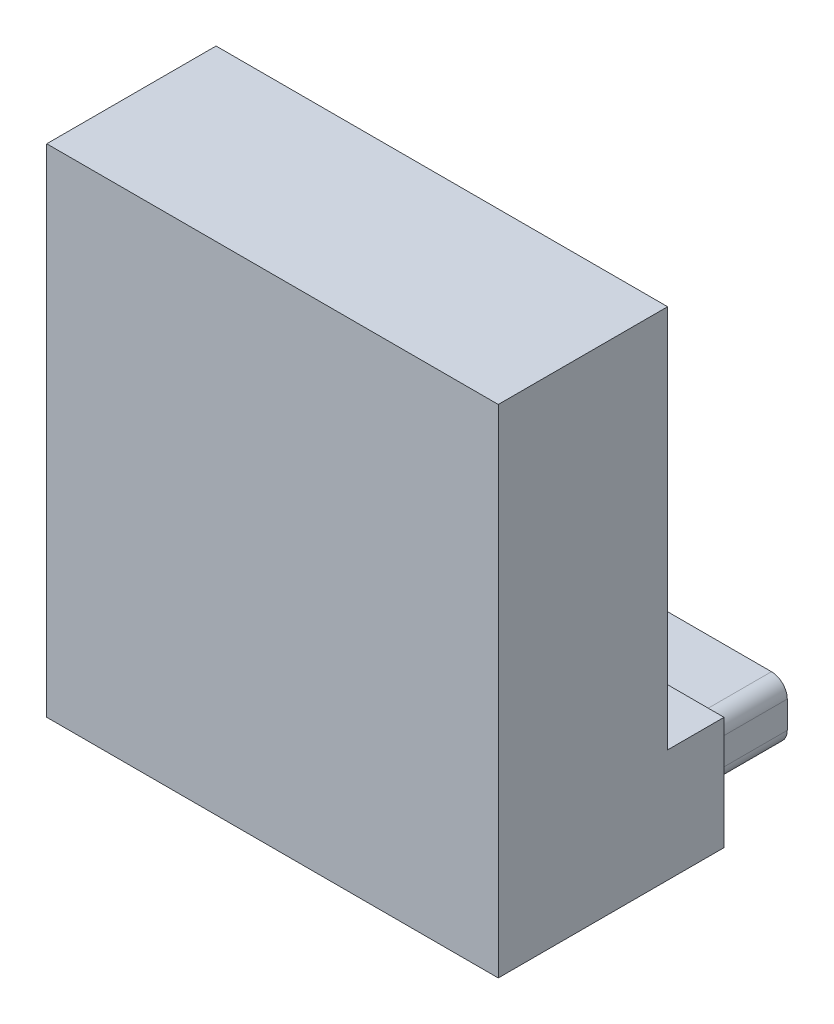
ISO-10303-21;
HEADER;
FILE_DESCRIPTION(('STEP AP214'),'2;1');
FILE_NAME('part.step','',(''),(''),'','','');
FILE_SCHEMA(('AUTOMOTIVE_DESIGN { 1 0 10303 214 1 1 1 1 }'));
ENDSEC;
DATA;
#1=APPLICATION_CONTEXT('core data for automotive mechanical design processes');
#2=APPLICATION_PROTOCOL_DEFINITION('international standard','automotive_design',2000,#1);
#3=PRODUCT_CONTEXT('',#1,'mechanical');
#4=PRODUCT('Part','Part','',(#3));
#5=PRODUCT_RELATED_PRODUCT_CATEGORY('part','',(#4));
#6=PRODUCT_DEFINITION_FORMATION('','',#4);
#7=PRODUCT_DEFINITION_CONTEXT('part definition',#1,'design');
#8=PRODUCT_DEFINITION('design','',#6,#7);
#9=PRODUCT_DEFINITION_SHAPE('','',#8);
#10=(LENGTH_UNIT() NAMED_UNIT(*) SI_UNIT(.MILLI.,.METRE.));
#11=(NAMED_UNIT(*) PLANE_ANGLE_UNIT() SI_UNIT($,.RADIAN.));
#12=(NAMED_UNIT(*) SI_UNIT($,.STERADIAN.) SOLID_ANGLE_UNIT());
#13=UNCERTAINTY_MEASURE_WITH_UNIT(LENGTH_MEASURE(1.E-05),#10,'distance_accuracy_value','');
#14=(GEOMETRIC_REPRESENTATION_CONTEXT(3) GLOBAL_UNCERTAINTY_ASSIGNED_CONTEXT((#13)) GLOBAL_UNIT_ASSIGNED_CONTEXT((#10,
#11,#12)) REPRESENTATION_CONTEXT('',''));
#15=CARTESIAN_POINT('',(0.,0.,0.));
#16=DIRECTION('',(0.,0.,1.));
#17=DIRECTION('',(1.,0.,0.));
#18=AXIS2_PLACEMENT_3D('',#15,#16,#17);
#19=CARTESIAN_POINT('',(-10.,22.,-2.5));
#20=DIRECTION('',(0.,0.,1.));
#21=DIRECTION('',(1.,0.,0.));
#22=AXIS2_PLACEMENT_3D('',#19,#20,#21);
#23=PLANE('',#22);
#24=DIRECTION('',(-1.,0.,0.));
#25=VECTOR('',#24,1.);
#26=CARTESIAN_POINT('',(-10.,5.,-2.5));
#27=LINE('',#26,#25);
#28=CARTESIAN_POINT('',(10.,5.,-2.5));
#29=VERTEX_POINT('',#28);
#30=CARTESIAN_POINT('',(-10.,5.,-2.5));
#31=VERTEX_POINT('',#30);
#32=EDGE_CURVE('E50',#29,#31,#27,.T.);
#33=ORIENTED_EDGE('',*,*,#32,.T.);
#34=DIRECTION('',(0.,-1.,0.));
#35=VECTOR('',#34,1.);
#36=CARTESIAN_POINT('',(-10.,22.,-2.5));
#37=LINE('',#36,#35);
#38=CARTESIAN_POINT('',(-10.,22.,-2.5));
#39=VERTEX_POINT('',#38);
#40=EDGE_CURVE('E169',#39,#31,#37,.T.);
#41=ORIENTED_EDGE('',*,*,#40,.F.);
#42=DIRECTION('',(-1.,0.,0.));
#43=VECTOR('',#42,1.);
#44=CARTESIAN_POINT('',(-10.,22.,-2.5));
#45=LINE('',#44,#43);
#46=CARTESIAN_POINT('',(10.,22.,-2.5));
#47=VERTEX_POINT('',#46);
#48=EDGE_CURVE('E160',#47,#39,#45,.T.);
#49=ORIENTED_EDGE('',*,*,#48,.F.);
#50=DIRECTION('',(0.,-1.,0.));
#51=VECTOR('',#50,1.);
#52=CARTESIAN_POINT('',(10.,22.,-2.5));
#53=LINE('',#52,#51);
#54=EDGE_CURVE('E180',#47,#29,#53,.T.);
#55=ORIENTED_EDGE('',*,*,#54,.T.);
#56=EDGE_LOOP('',(#33,#41,#49,#55));
#57=FACE_BOUND('',#56,.T.);
#58=CARTESIAN_POINT('',(0.,12.,-2.5));
#59=DIRECTION('',(0.,0.,1.));
#60=DIRECTION('',(1.,0.,0.));
#61=AXIS2_PLACEMENT_3D('',#58,#59,#60);
#62=CIRCLE('',#61,2.1);
#63=CARTESIAN_POINT('',(2.1,12.,-2.5));
#64=VERTEX_POINT('',#63);
#65=EDGE_CURVE('E11',#64,#64,#62,.F.);
#66=ORIENTED_EDGE('',*,*,#65,.F.);
#67=EDGE_LOOP('',(#66));
#68=FACE_BOUND('',#67,.T.);
#69=ADVANCED_FACE('F35',(#57,#68),#23,.F.);
#70=CARTESIAN_POINT('',(10.,5.,5.));
#71=DIRECTION('',(-1.,0.,0.));
#72=DIRECTION('',(0.,0.,1.));
#73=AXIS2_PLACEMENT_3D('',#70,#71,#72);
#74=PLANE('',#73);
#75=DIRECTION('',(0.,0.,-1.));
#76=VECTOR('',#75,1.);
#77=CARTESIAN_POINT('',(10.,0.,5.));
#78=LINE('',#77,#76);
#79=CARTESIAN_POINT('',(10.,0.,5.));
#80=VERTEX_POINT('',#79);
#81=CARTESIAN_POINT('',(10.,0.,-5.));
#82=VERTEX_POINT('',#81);
#83=EDGE_CURVE('E254',#80,#82,#78,.T.);
#84=ORIENTED_EDGE('',*,*,#83,.T.);
#85=DIRECTION('',(0.,-1.,0.));
#86=VECTOR('',#85,1.);
#87=CARTESIAN_POINT('',(10.,5.,-5.));
#88=LINE('',#87,#86);
#89=CARTESIAN_POINT('',(10.,5.,-5.));
#90=VERTEX_POINT('',#89);
#91=EDGE_CURVE('E244',#90,#82,#88,.T.);
#92=ORIENTED_EDGE('',*,*,#91,.F.);
#93=DIRECTION('',(0.,0.,-1.));
#94=VECTOR('',#93,1.);
#95=CARTESIAN_POINT('',(10.,5.,5.));
#96=LINE('',#95,#94);
#97=EDGE_CURVE('E208',#29,#90,#96,.T.);
#98=ORIENTED_EDGE('',*,*,#97,.F.);
#99=ORIENTED_EDGE('',*,*,#54,.F.);
#100=DIRECTION('',(0.,0.,-1.));
#101=VECTOR('',#100,1.);
#102=CARTESIAN_POINT('',(10.,22.,5.));
#103=LINE('',#102,#101);
#104=CARTESIAN_POINT('',(10.,22.,5.));
#105=VERTEX_POINT('',#104);
#106=EDGE_CURVE('E156',#105,#47,#103,.T.);
#107=ORIENTED_EDGE('',*,*,#106,.F.);
#108=DIRECTION('',(0.,-1.,0.));
#109=VECTOR('',#108,1.);
#110=CARTESIAN_POINT('',(10.,5.,5.));
#111=LINE('',#110,#109);
#112=EDGE_CURVE('E149',#105,#80,#111,.T.);
#113=ORIENTED_EDGE('',*,*,#112,.T.);
#114=EDGE_LOOP('',(#84,#92,#98,#99,#107,#113));
#115=FACE_BOUND('',#114,.T.);
#116=ADVANCED_FACE('F309',(#115),#74,.F.);
#117=CARTESIAN_POINT('',(10.,5.,-5.));
#118=DIRECTION('',(0.,0.,1.));
#119=DIRECTION('',(1.,0.,0.));
#120=AXIS2_PLACEMENT_3D('',#117,#118,#119);
#121=PLANE('',#120);
#122=DIRECTION('',(1.,0.,0.));
#123=VECTOR('',#122,1.);
#124=CARTESIAN_POINT('',(-8.8,3.8,-5.));
#125=LINE('',#124,#123);
#126=CARTESIAN_POINT('',(-8.1,3.8,-5.));
#127=VERTEX_POINT('',#126);
#128=CARTESIAN_POINT('',(8.1,3.8,-5.));
#129=VERTEX_POINT('',#128);
#130=EDGE_CURVE('E202',#127,#129,#125,.T.);
#131=ORIENTED_EDGE('',*,*,#130,.F.);
#132=CARTESIAN_POINT('',(-8.1,3.1,-5.));
#133=DIRECTION('',(0.,0.,1.));
#134=DIRECTION('',(1.,0.,0.));
#135=AXIS2_PLACEMENT_3D('',#132,#133,#134);
#136=CIRCLE('',#135,0.7);
#137=CARTESIAN_POINT('',(-8.8,3.1,-5.));
#138=VERTEX_POINT('',#137);
#139=EDGE_CURVE('E43',#127,#138,#136,.T.);
#140=ORIENTED_EDGE('',*,*,#139,.T.);
#141=DIRECTION('',(0.,-1.,0.));
#142=VECTOR('',#141,1.);
#143=CARTESIAN_POINT('',(-8.8,3.8,-5.));
#144=LINE('',#143,#142);
#145=CARTESIAN_POINT('',(-8.8,1.9,-5.));
#146=VERTEX_POINT('',#145);
#147=EDGE_CURVE('E184',#138,#146,#144,.T.);
#148=ORIENTED_EDGE('',*,*,#147,.T.);
#149=CARTESIAN_POINT('',(-8.1,1.9,-5.));
#150=DIRECTION('',(0.,0.,1.));
#151=DIRECTION('',(1.,0.,0.));
#152=AXIS2_PLACEMENT_3D('',#149,#150,#151);
#153=CIRCLE('',#152,0.7);
#154=CARTESIAN_POINT('',(-8.1,1.2,-5.));
#155=VERTEX_POINT('',#154);
#156=EDGE_CURVE('E58',#146,#155,#153,.T.);
#157=ORIENTED_EDGE('',*,*,#156,.T.);
#158=DIRECTION('',(1.,0.,0.));
#159=VECTOR('',#158,1.);
#160=CARTESIAN_POINT('',(-8.8,1.2,-5.));
#161=LINE('',#160,#159);
#162=CARTESIAN_POINT('',(8.1,1.2,-5.));
#163=VERTEX_POINT('',#162);
#164=EDGE_CURVE('E189',#155,#163,#161,.T.);
#165=ORIENTED_EDGE('',*,*,#164,.T.);
#166=CARTESIAN_POINT('',(8.1,1.9,-5.));
#167=DIRECTION('',(0.,0.,1.));
#168=DIRECTION('',(1.,0.,0.));
#169=AXIS2_PLACEMENT_3D('',#166,#167,#168);
#170=CIRCLE('',#169,0.7);
#171=CARTESIAN_POINT('',(8.8,1.9,-5.));
#172=VERTEX_POINT('',#171);
#173=EDGE_CURVE('E215',#163,#172,#170,.T.);
#174=ORIENTED_EDGE('',*,*,#173,.T.);
#175=DIRECTION('',(0.,-1.,0.));
#176=VECTOR('',#175,1.);
#177=CARTESIAN_POINT('',(8.8,3.8,-5.));
#178=LINE('',#177,#176);
#179=CARTESIAN_POINT('',(8.8,3.1,-5.));
#180=VERTEX_POINT('',#179);
#181=EDGE_CURVE('E194',#180,#172,#178,.T.);
#182=ORIENTED_EDGE('',*,*,#181,.F.);
#183=CARTESIAN_POINT('',(8.1,3.1,-5.));
#184=DIRECTION('',(0.,0.,1.));
#185=DIRECTION('',(1.,0.,0.));
#186=AXIS2_PLACEMENT_3D('',#183,#184,#185);
#187=CIRCLE('',#186,0.7);
#188=EDGE_CURVE('E213',#180,#129,#187,.T.);
#189=ORIENTED_EDGE('',*,*,#188,.T.);
#190=EDGE_LOOP('',(#131,#140,#148,#157,#165,#174,#182,#189));
#191=FACE_BOUND('',#190,.T.);
#192=DIRECTION('',(-1.,0.,0.));
#193=VECTOR('',#192,1.);
#194=CARTESIAN_POINT('',(10.,0.,-5.));
#195=LINE('',#194,#193);
#196=CARTESIAN_POINT('',(-10.,0.,-5.));
#197=VERTEX_POINT('',#196);
#198=EDGE_CURVE('E251',#82,#197,#195,.T.);
#199=ORIENTED_EDGE('',*,*,#198,.T.);
#200=DIRECTION('',(0.,-1.,0.));
#201=VECTOR('',#200,1.);
#202=CARTESIAN_POINT('',(-10.,5.,-5.));
#203=LINE('',#202,#201);
#204=CARTESIAN_POINT('',(-10.,5.,-5.));
#205=VERTEX_POINT('',#204);
#206=EDGE_CURVE('E148',#205,#197,#203,.T.);
#207=ORIENTED_EDGE('',*,*,#206,.F.);
#208=DIRECTION('',(-1.,0.,0.));
#209=VECTOR('',#208,1.);
#210=CARTESIAN_POINT('',(10.,5.,-5.));
#211=LINE('',#210,#209);
#212=EDGE_CURVE('E207',#90,#205,#211,.T.);
#213=ORIENTED_EDGE('',*,*,#212,.F.);
#214=ORIENTED_EDGE('',*,*,#91,.T.);
#215=EDGE_LOOP('',(#199,#207,#213,#214));
#216=FACE_BOUND('',#215,.T.);
#217=ADVANCED_FACE('F288',(#191,#216),#121,.F.);
#218=CARTESIAN_POINT('',(-10.,5.,5.));
#219=DIRECTION('',(-1.,0.,0.));
#220=DIRECTION('',(0.,0.,1.));
#221=AXIS2_PLACEMENT_3D('',#218,#219,#220);
#222=PLANE('',#221);
#223=DIRECTION('',(0.,0.,-1.));
#224=VECTOR('',#223,1.);
#225=CARTESIAN_POINT('',(-10.,0.,5.));
#226=LINE('',#225,#224);
#227=CARTESIAN_POINT('',(-10.,0.,5.));
#228=VERTEX_POINT('',#227);
#229=EDGE_CURVE('E144',#228,#197,#226,.T.);
#230=ORIENTED_EDGE('',*,*,#229,.F.);
#231=DIRECTION('',(0.,-1.,0.));
#232=VECTOR('',#231,1.);
#233=CARTESIAN_POINT('',(-10.,5.,5.));
#234=LINE('',#233,#232);
#235=CARTESIAN_POINT('',(-10.,22.,5.));
#236=VERTEX_POINT('',#235);
#237=EDGE_CURVE('E137',#236,#228,#234,.T.);
#238=ORIENTED_EDGE('',*,*,#237,.F.);
#239=DIRECTION('',(0.,0.,1.));
#240=VECTOR('',#239,1.);
#241=CARTESIAN_POINT('',(-10.,22.,5.));
#242=LINE('',#241,#240);
#243=EDGE_CURVE('E142',#39,#236,#242,.T.);
#244=ORIENTED_EDGE('',*,*,#243,.F.);
#245=ORIENTED_EDGE('',*,*,#40,.T.);
#246=DIRECTION('',(0.,0.,-1.));
#247=VECTOR('',#246,1.);
#248=CARTESIAN_POINT('',(-10.,5.,5.));
#249=LINE('',#248,#247);
#250=EDGE_CURVE('E176',#31,#205,#249,.T.);
#251=ORIENTED_EDGE('',*,*,#250,.T.);
#252=ORIENTED_EDGE('',*,*,#206,.T.);
#253=EDGE_LOOP('',(#230,#238,#244,#245,#251,#252));
#254=FACE_BOUND('',#253,.T.);
#255=ADVANCED_FACE('F139',(#254),#222,.T.);
#256=CARTESIAN_POINT('',(10.,5.,5.));
#257=DIRECTION('',(0.,0.,1.));
#258=DIRECTION('',(1.,0.,0.));
#259=AXIS2_PLACEMENT_3D('',#256,#257,#258);
#260=PLANE('',#259);
#261=DIRECTION('',(-1.,0.,0.));
#262=VECTOR('',#261,1.);
#263=CARTESIAN_POINT('',(10.,0.,5.));
#264=LINE('',#263,#262);
#265=EDGE_CURVE('E210',#80,#228,#264,.T.);
#266=ORIENTED_EDGE('',*,*,#265,.F.);
#267=ORIENTED_EDGE('',*,*,#112,.F.);
#268=DIRECTION('',(1.,0.,0.));
#269=VECTOR('',#268,1.);
#270=CARTESIAN_POINT('',(-10.,22.,5.));
#271=LINE('',#270,#269);
#272=EDGE_CURVE('E152',#236,#105,#271,.T.);
#273=ORIENTED_EDGE('',*,*,#272,.F.);
#274=ORIENTED_EDGE('',*,*,#237,.T.);
#275=EDGE_LOOP('',(#266,#267,#273,#274));
#276=FACE_BOUND('',#275,.T.);
#277=ADVANCED_FACE('F153',(#276),#260,.T.);
#278=CARTESIAN_POINT('',(0.,5.,0.));
#279=DIRECTION('',(0.,1.,0.));
#280=DIRECTION('',(0.,0.,1.));
#281=AXIS2_PLACEMENT_3D('',#278,#279,#280);
#282=PLANE('',#281);
#283=ORIENTED_EDGE('',*,*,#32,.F.);
#284=ORIENTED_EDGE('',*,*,#97,.T.);
#285=ORIENTED_EDGE('',*,*,#212,.T.);
#286=ORIENTED_EDGE('',*,*,#250,.F.);
#287=EDGE_LOOP('',(#283,#284,#285,#286));
#288=FACE_BOUND('',#287,.T.);
#289=ADVANCED_FACE('F329',(#288),#282,.T.);
#290=CARTESIAN_POINT('',(0.,0.,0.));
#291=DIRECTION('',(0.,1.,0.));
#292=DIRECTION('',(0.,0.,1.));
#293=AXIS2_PLACEMENT_3D('',#290,#291,#292);
#294=PLANE('',#293);
#295=ORIENTED_EDGE('',*,*,#83,.F.);
#296=ORIENTED_EDGE('',*,*,#265,.T.);
#297=ORIENTED_EDGE('',*,*,#229,.T.);
#298=ORIENTED_EDGE('',*,*,#198,.F.);
#299=EDGE_LOOP('',(#295,#296,#297,#298));
#300=FACE_BOUND('',#299,.T.);
#301=ADVANCED_FACE('F328',(#300),#294,.F.);
#302=CARTESIAN_POINT('',(-8.8,3.8,-9.));
#303=DIRECTION('',(-1.,0.,0.));
#304=DIRECTION('',(0.,0.,1.));
#305=AXIS2_PLACEMENT_3D('',#302,#303,#304);
#306=PLANE('',#305);
#307=DIRECTION('',(0.,-1.,0.));
#308=VECTOR('',#307,1.);
#309=CARTESIAN_POINT('',(-8.8,3.8,-9.));
#310=LINE('',#309,#308);
#311=CARTESIAN_POINT('',(-8.8,3.1,-9.));
#312=VERTEX_POINT('',#311);
#313=CARTESIAN_POINT('',(-8.8,1.9,-9.));
#314=VERTEX_POINT('',#313);
#315=EDGE_CURVE('E172',#312,#314,#310,.T.);
#316=ORIENTED_EDGE('',*,*,#315,.T.);
#317=DIRECTION('',(0.,0.,1.));
#318=VECTOR('',#317,1.);
#319=CARTESIAN_POINT('',(-8.8,1.9,-9.));
#320=LINE('',#319,#318);
#321=EDGE_CURVE('E217',#314,#146,#320,.T.);
#322=ORIENTED_EDGE('',*,*,#321,.T.);
#323=ORIENTED_EDGE('',*,*,#147,.F.);
#324=DIRECTION('',(0.,0.,1.));
#325=VECTOR('',#324,1.);
#326=CARTESIAN_POINT('',(-8.8,3.1,-9.));
#327=LINE('',#326,#325);
#328=EDGE_CURVE('E219',#138,#312,#327,.F.);
#329=ORIENTED_EDGE('',*,*,#328,.T.);
#330=EDGE_LOOP('',(#316,#322,#323,#329));
#331=FACE_BOUND('',#330,.T.);
#332=ADVANCED_FACE('F276',(#331),#306,.T.);
#333=CARTESIAN_POINT('',(-8.8,3.8,-9.));
#334=DIRECTION('',(0.,-1.,0.));
#335=DIRECTION('',(1.,0.,0.));
#336=AXIS2_PLACEMENT_3D('',#333,#334,#335);
#337=PLANE('',#336);
#338=ORIENTED_EDGE('',*,*,#130,.T.);
#339=DIRECTION('',(0.,0.,1.));
#340=VECTOR('',#339,1.);
#341=CARTESIAN_POINT('',(8.1,3.8,-9.));
#342=LINE('',#341,#340);
#343=CARTESIAN_POINT('',(8.1,3.8,-9.));
#344=VERTEX_POINT('',#343);
#345=EDGE_CURVE('E221',#129,#344,#342,.F.);
#346=ORIENTED_EDGE('',*,*,#345,.T.);
#347=DIRECTION('',(1.,0.,0.));
#348=VECTOR('',#347,1.);
#349=CARTESIAN_POINT('',(-8.8,3.8,-9.));
#350=LINE('',#349,#348);
#351=CARTESIAN_POINT('',(-8.1,3.8,-9.));
#352=VERTEX_POINT('',#351);
#353=EDGE_CURVE('E197',#352,#344,#350,.T.);
#354=ORIENTED_EDGE('',*,*,#353,.F.);
#355=DIRECTION('',(0.,0.,1.));
#356=VECTOR('',#355,1.);
#357=CARTESIAN_POINT('',(-8.1,3.8,-5.));
#358=LINE('',#357,#356);
#359=EDGE_CURVE('E223',#352,#127,#358,.T.);
#360=ORIENTED_EDGE('',*,*,#359,.T.);
#361=EDGE_LOOP('',(#338,#346,#354,#360));
#362=FACE_BOUND('',#361,.T.);
#363=ADVANCED_FACE('F298',(#362),#337,.F.);
#364=CARTESIAN_POINT('',(8.8,3.8,-9.));
#365=DIRECTION('',(-1.,0.,0.));
#366=DIRECTION('',(0.,0.,1.));
#367=AXIS2_PLACEMENT_3D('',#364,#365,#366);
#368=PLANE('',#367);
#369=ORIENTED_EDGE('',*,*,#181,.T.);
#370=DIRECTION('',(0.,0.,1.));
#371=VECTOR('',#370,1.);
#372=CARTESIAN_POINT('',(8.8,1.9,-9.));
#373=LINE('',#372,#371);
#374=CARTESIAN_POINT('',(8.8,1.9,-9.));
#375=VERTEX_POINT('',#374);
#376=EDGE_CURVE('E234',#172,#375,#373,.F.);
#377=ORIENTED_EDGE('',*,*,#376,.T.);
#378=DIRECTION('',(0.,-1.,0.));
#379=VECTOR('',#378,1.);
#380=CARTESIAN_POINT('',(8.8,3.8,-9.));
#381=LINE('',#380,#379);
#382=CARTESIAN_POINT('',(8.8,3.1,-9.));
#383=VERTEX_POINT('',#382);
#384=EDGE_CURVE('E261',#383,#375,#381,.T.);
#385=ORIENTED_EDGE('',*,*,#384,.F.);
#386=DIRECTION('',(0.,0.,1.));
#387=VECTOR('',#386,1.);
#388=CARTESIAN_POINT('',(8.8,3.1,-9.));
#389=LINE('',#388,#387);
#390=EDGE_CURVE('E236',#383,#180,#389,.T.);
#391=ORIENTED_EDGE('',*,*,#390,.T.);
#392=EDGE_LOOP('',(#369,#377,#385,#391));
#393=FACE_BOUND('',#392,.T.);
#394=ADVANCED_FACE('F292',(#393),#368,.F.);
#395=CARTESIAN_POINT('',(-8.8,1.2,-9.));
#396=DIRECTION('',(0.,-1.,0.));
#397=DIRECTION('',(1.,0.,0.));
#398=AXIS2_PLACEMENT_3D('',#395,#396,#397);
#399=PLANE('',#398);
#400=DIRECTION('',(1.,0.,0.));
#401=VECTOR('',#400,1.);
#402=CARTESIAN_POINT('',(-8.8,1.2,-9.));
#403=LINE('',#402,#401);
#404=CARTESIAN_POINT('',(-8.1,1.2,-9.));
#405=VERTEX_POINT('',#404);
#406=CARTESIAN_POINT('',(8.1,1.2,-9.));
#407=VERTEX_POINT('',#406);
#408=EDGE_CURVE('E266',#405,#407,#403,.T.);
#409=ORIENTED_EDGE('',*,*,#408,.T.);
#410=DIRECTION('',(0.,0.,1.));
#411=VECTOR('',#410,1.);
#412=CARTESIAN_POINT('',(8.1,1.2,-5.));
#413=LINE('',#412,#411);
#414=EDGE_CURVE('E239',#407,#163,#413,.T.);
#415=ORIENTED_EDGE('',*,*,#414,.T.);
#416=ORIENTED_EDGE('',*,*,#164,.F.);
#417=DIRECTION('',(0.,0.,1.));
#418=VECTOR('',#417,1.);
#419=CARTESIAN_POINT('',(-8.1,1.2,-9.));
#420=LINE('',#419,#418);
#421=EDGE_CURVE('E242',#155,#405,#420,.F.);
#422=ORIENTED_EDGE('',*,*,#421,.T.);
#423=EDGE_LOOP('',(#409,#415,#416,#422));
#424=FACE_BOUND('',#423,.T.);
#425=ADVANCED_FACE('F286',(#424),#399,.T.);
#426=CARTESIAN_POINT('',(0.,0.,-9.));
#427=DIRECTION('',(0.,0.,1.));
#428=DIRECTION('',(1.,0.,0.));
#429=AXIS2_PLACEMENT_3D('',#426,#427,#428);
#430=PLANE('',#429);
#431=ORIENTED_EDGE('',*,*,#384,.T.);
#432=CARTESIAN_POINT('',(8.1,1.9,-9.));
#433=DIRECTION('',(0.,0.,1.));
#434=DIRECTION('',(1.,0.,0.));
#435=AXIS2_PLACEMENT_3D('',#432,#433,#434);
#436=CIRCLE('',#435,0.7);
#437=EDGE_CURVE('E226',#375,#407,#436,.F.);
#438=ORIENTED_EDGE('',*,*,#437,.T.);
#439=ORIENTED_EDGE('',*,*,#408,.F.);
#440=CARTESIAN_POINT('',(-8.1,1.9,-9.));
#441=DIRECTION('',(0.,0.,1.));
#442=DIRECTION('',(1.,0.,0.));
#443=AXIS2_PLACEMENT_3D('',#440,#441,#442);
#444=CIRCLE('',#443,0.7);
#445=EDGE_CURVE('E230',#405,#314,#444,.F.);
#446=ORIENTED_EDGE('',*,*,#445,.T.);
#447=ORIENTED_EDGE('',*,*,#315,.F.);
#448=CARTESIAN_POINT('',(-8.1,3.1,-9.));
#449=DIRECTION('',(0.,0.,1.));
#450=DIRECTION('',(1.,0.,0.));
#451=AXIS2_PLACEMENT_3D('',#448,#449,#450);
#452=CIRCLE('',#451,0.7);
#453=EDGE_CURVE('E232',#312,#352,#452,.F.);
#454=ORIENTED_EDGE('',*,*,#453,.T.);
#455=ORIENTED_EDGE('',*,*,#353,.T.);
#456=CARTESIAN_POINT('',(8.1,3.1,-9.));
#457=DIRECTION('',(0.,0.,1.));
#458=DIRECTION('',(1.,0.,0.));
#459=AXIS2_PLACEMENT_3D('',#456,#457,#458);
#460=CIRCLE('',#459,0.7);
#461=EDGE_CURVE('E228',#344,#383,#460,.F.);
#462=ORIENTED_EDGE('',*,*,#461,.T.);
#463=EDGE_LOOP('',(#431,#438,#439,#446,#447,#454,#455,#462));
#464=FACE_BOUND('',#463,.T.);
#465=ADVANCED_FACE('F281',(#464),#430,.F.);
#466=CARTESIAN_POINT('',(8.1,1.9,-9.));
#467=DIRECTION('',(0.,0.,-1.));
#468=DIRECTION('',(-1.,0.,0.));
#469=AXIS2_PLACEMENT_3D('',#466,#467,#468);
#470=CYLINDRICAL_SURFACE('',#469,0.7);
#471=ORIENTED_EDGE('',*,*,#437,.F.);
#472=ORIENTED_EDGE('',*,*,#376,.F.);
#473=ORIENTED_EDGE('',*,*,#173,.F.);
#474=ORIENTED_EDGE('',*,*,#414,.F.);
#475=EDGE_LOOP('',(#471,#472,#473,#474));
#476=FACE_BOUND('',#475,.T.);
#477=ADVANCED_FACE('F284',(#476),#470,.T.);
#478=CARTESIAN_POINT('',(8.1,3.1,-9.));
#479=DIRECTION('',(0.,0.,1.));
#480=DIRECTION('',(1.,0.,0.));
#481=AXIS2_PLACEMENT_3D('',#478,#479,#480);
#482=CYLINDRICAL_SURFACE('',#481,0.7);
#483=ORIENTED_EDGE('',*,*,#461,.F.);
#484=ORIENTED_EDGE('',*,*,#345,.F.);
#485=ORIENTED_EDGE('',*,*,#188,.F.);
#486=ORIENTED_EDGE('',*,*,#390,.F.);
#487=EDGE_LOOP('',(#483,#484,#485,#486));
#488=FACE_BOUND('',#487,.T.);
#489=ADVANCED_FACE('F295',(#488),#482,.T.);
#490=CARTESIAN_POINT('',(-8.1,1.9,-9.));
#491=DIRECTION('',(0.,0.,1.));
#492=DIRECTION('',(1.,0.,0.));
#493=AXIS2_PLACEMENT_3D('',#490,#491,#492);
#494=CYLINDRICAL_SURFACE('',#493,0.7);
#495=ORIENTED_EDGE('',*,*,#445,.F.);
#496=ORIENTED_EDGE('',*,*,#421,.F.);
#497=ORIENTED_EDGE('',*,*,#156,.F.);
#498=ORIENTED_EDGE('',*,*,#321,.F.);
#499=EDGE_LOOP('',(#495,#496,#497,#498));
#500=FACE_BOUND('',#499,.T.);
#501=ADVANCED_FACE('F280',(#500),#494,.T.);
#502=CARTESIAN_POINT('',(-8.1,3.1,-9.));
#503=DIRECTION('',(0.,0.,-1.));
#504=DIRECTION('',(-1.,0.,0.));
#505=AXIS2_PLACEMENT_3D('',#502,#503,#504);
#506=CYLINDRICAL_SURFACE('',#505,0.7);
#507=ORIENTED_EDGE('',*,*,#453,.F.);
#508=ORIENTED_EDGE('',*,*,#328,.F.);
#509=ORIENTED_EDGE('',*,*,#139,.F.);
#510=ORIENTED_EDGE('',*,*,#359,.F.);
#511=EDGE_LOOP('',(#507,#508,#509,#510));
#512=FACE_BOUND('',#511,.T.);
#513=ADVANCED_FACE('F37',(#512),#506,.T.);
#514=CARTESIAN_POINT('',(0.,22.,0.));
#515=DIRECTION('',(0.,-1.,0.));
#516=DIRECTION('',(0.,0.,-1.));
#517=AXIS2_PLACEMENT_3D('',#514,#515,#516);
#518=PLANE('',#517);
#519=ORIENTED_EDGE('',*,*,#243,.T.);
#520=ORIENTED_EDGE('',*,*,#272,.T.);
#521=ORIENTED_EDGE('',*,*,#106,.T.);
#522=ORIENTED_EDGE('',*,*,#48,.T.);
#523=EDGE_LOOP('',(#519,#520,#521,#522));
#524=FACE_BOUND('',#523,.T.);
#525=ADVANCED_FACE('F158',(#524),#518,.F.);
#526=CARTESIAN_POINT('',(0.,12.,-14.939696961967));
#527=DIRECTION('',(0.,0.,1.));
#528=DIRECTION('',(1.,0.,0.));
#529=AXIS2_PLACEMENT_3D('',#526,#527,#528);
#530=CYLINDRICAL_SURFACE('',#529,2.1);
#531=CARTESIAN_POINT('',(0.,12.,-9.));
#532=DIRECTION('',(0.,0.,1.));
#533=DIRECTION('',(1.,0.,0.));
#534=AXIS2_PLACEMENT_3D('',#531,#532,#533);
#535=CIRCLE('',#534,2.1);
#536=CARTESIAN_POINT('',(2.1,12.,-9.));
#537=VERTEX_POINT('',#536);
#538=EDGE_CURVE('E163',#537,#537,#535,.T.);
#539=ORIENTED_EDGE('',*,*,#538,.T.);
#540=EDGE_LOOP('',(#539));
#541=FACE_BOUND('',#540,.T.);
#542=ORIENTED_EDGE('',*,*,#65,.T.);
#543=EDGE_LOOP('',(#542));
#544=FACE_BOUND('',#543,.T.);
#545=ADVANCED_FACE('F307',(#541,#544),#530,.T.);
#546=CARTESIAN_POINT('',(0.,0.,-9.));
#547=DIRECTION('',(0.,0.,1.));
#548=DIRECTION('',(1.,0.,0.));
#549=AXIS2_PLACEMENT_3D('',#546,#547,#548);
#550=PLANE('',#549);
#551=ORIENTED_EDGE('',*,*,#538,.F.);
#552=EDGE_LOOP('',(#551));
#553=FACE_BOUND('',#552,.T.);
#554=ADVANCED_FACE('F400',(#553),#550,.F.);
#555=CLOSED_SHELL('',(#69,#116,#217,#255,#277,#289,#301,#332,#363,#394,#425,#465,#477,#489,#501,
#513,#525,#545,#554));
#556=MANIFOLD_SOLID_BREP('B2',#555);
#557=ADVANCED_BREP_SHAPE_REPRESENTATION('',(#18,#556),#14);
#558=SHAPE_DEFINITION_REPRESENTATION(#9,#557);
ENDSEC;
END-ISO-10303-21;
